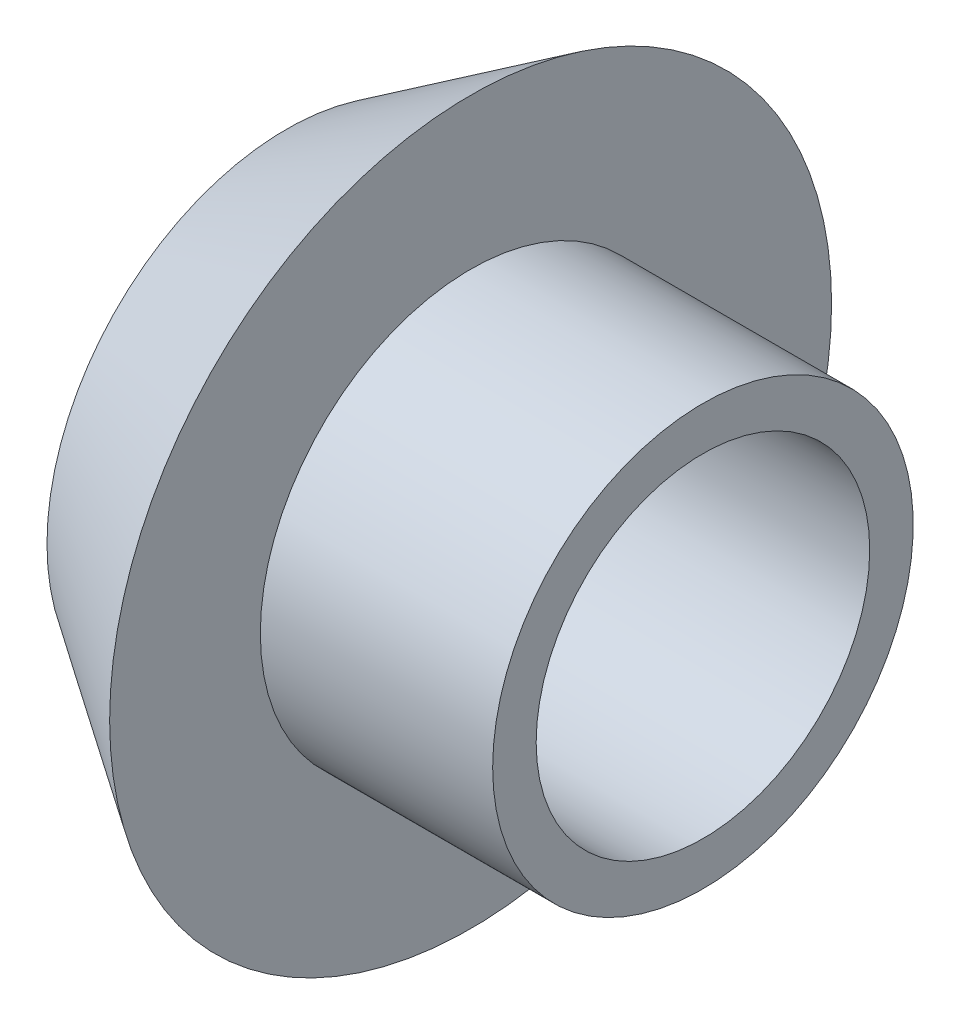
ISO-10303-21;
HEADER;
FILE_DESCRIPTION(('STEP AP214'),'2;1');
FILE_NAME('part.step','',(''),(''),'','','');
FILE_SCHEMA(('AUTOMOTIVE_DESIGN { 1 0 10303 214 1 1 1 1 }'));
ENDSEC;
DATA;
#1=APPLICATION_CONTEXT('core data for automotive mechanical design processes');
#2=APPLICATION_PROTOCOL_DEFINITION('international standard','automotive_design',2000,#1);
#3=PRODUCT_CONTEXT('',#1,'mechanical');
#4=PRODUCT('Part','Part','',(#3));
#5=PRODUCT_RELATED_PRODUCT_CATEGORY('part','',(#4));
#6=PRODUCT_DEFINITION_FORMATION('','',#4);
#7=PRODUCT_DEFINITION_CONTEXT('part definition',#1,'design');
#8=PRODUCT_DEFINITION('design','',#6,#7);
#9=PRODUCT_DEFINITION_SHAPE('','',#8);
#10=(LENGTH_UNIT() NAMED_UNIT(*) SI_UNIT(.MILLI.,.METRE.));
#11=(NAMED_UNIT(*) PLANE_ANGLE_UNIT() SI_UNIT($,.RADIAN.));
#12=(NAMED_UNIT(*) SI_UNIT($,.STERADIAN.) SOLID_ANGLE_UNIT());
#13=UNCERTAINTY_MEASURE_WITH_UNIT(LENGTH_MEASURE(1.E-05),#10,'distance_accuracy_value','');
#14=(GEOMETRIC_REPRESENTATION_CONTEXT(3) GLOBAL_UNCERTAINTY_ASSIGNED_CONTEXT((#13)) GLOBAL_UNIT_ASSIGNED_CONTEXT((#10,
#11,#12)) REPRESENTATION_CONTEXT('',''));
#15=CARTESIAN_POINT('',(0.,0.,0.));
#16=DIRECTION('',(0.,0.,1.));
#17=DIRECTION('',(1.,0.,0.));
#18=AXIS2_PLACEMENT_3D('',#15,#16,#17);
#19=CARTESIAN_POINT('',(-14.36,11.5,0.));
#20=DIRECTION('',(1.,0.,0.));
#21=DIRECTION('',(0.,0.,-1.));
#22=AXIS2_PLACEMENT_3D('',#19,#20,#21);
#23=PLANE('',#22);
#24=CARTESIAN_POINT('',(-14.36,0.,0.));
#25=DIRECTION('',(-1.,0.,0.));
#26=DIRECTION('',(0.,0.,1.));
#27=AXIS2_PLACEMENT_3D('',#24,#25,#26);
#28=CIRCLE('',#27,11.5);
#29=CARTESIAN_POINT('',(-14.36,0.,11.5));
#30=VERTEX_POINT('',#29);
#31=EDGE_CURVE('E52',#30,#30,#28,.T.);
#32=ORIENTED_EDGE('',*,*,#31,.F.);
#33=EDGE_LOOP('',(#32));
#34=FACE_BOUND('',#33,.T.);
#35=CARTESIAN_POINT('',(-14.36,0.,0.));
#36=DIRECTION('',(-1.,0.,0.));
#37=DIRECTION('',(0.,0.,1.));
#38=AXIS2_PLACEMENT_3D('',#35,#36,#37);
#39=CIRCLE('',#38,16.51);
#40=CARTESIAN_POINT('',(-14.36,0.,16.51));
#41=VERTEX_POINT('',#40);
#42=EDGE_CURVE('E10',#41,#41,#39,.T.);
#43=ORIENTED_EDGE('',*,*,#42,.T.);
#44=EDGE_LOOP('',(#43));
#45=FACE_BOUND('',#44,.T.);
#46=ADVANCED_FACE('F30',(#34,#45),#23,.F.);
#47=CARTESIAN_POINT('',(-1.66,0.,0.));
#48=DIRECTION('',(1.,0.,0.));
#49=DIRECTION('',(0.,0.,-1.));
#50=AXIS2_PLACEMENT_3D('',#47,#48,#49);
#51=CONICAL_SURFACE('',#50,24.89,0.583263302538101);
#52=ORIENTED_EDGE('',*,*,#42,.F.);
#53=EDGE_LOOP('',(#52));
#54=FACE_BOUND('',#53,.T.);
#55=CARTESIAN_POINT('',(-1.66,0.,0.));
#56=DIRECTION('',(-1.,0.,0.));
#57=DIRECTION('',(0.,0.,1.));
#58=AXIS2_PLACEMENT_3D('',#55,#56,#57);
#59=CIRCLE('',#58,24.89);
#60=CARTESIAN_POINT('',(-1.66,0.,24.89));
#61=VERTEX_POINT('',#60);
#62=EDGE_CURVE('E36',#61,#61,#59,.T.);
#63=ORIENTED_EDGE('',*,*,#62,.T.);
#64=EDGE_LOOP('',(#63));
#65=FACE_BOUND('',#64,.T.);
#66=ADVANCED_FACE('F59',(#54,#65),#51,.T.);
#67=CARTESIAN_POINT('',(-1.66,24.89,0.));
#68=DIRECTION('',(-1.,0.,0.));
#69=DIRECTION('',(0.,0.,1.));
#70=AXIS2_PLACEMENT_3D('',#67,#68,#69);
#71=PLANE('',#70);
#72=ORIENTED_EDGE('',*,*,#62,.F.);
#73=EDGE_LOOP('',(#72));
#74=FACE_BOUND('',#73,.T.);
#75=CARTESIAN_POINT('',(-1.66,0.,0.));
#76=DIRECTION('',(-1.,0.,0.));
#77=DIRECTION('',(0.,0.,1.));
#78=AXIS2_PLACEMENT_3D('',#75,#76,#77);
#79=CIRCLE('',#78,14.5);
#80=CARTESIAN_POINT('',(-1.66,0.,14.5));
#81=VERTEX_POINT('',#80);
#82=EDGE_CURVE('E40',#81,#81,#79,.T.);
#83=ORIENTED_EDGE('',*,*,#82,.T.);
#84=EDGE_LOOP('',(#83));
#85=FACE_BOUND('',#84,.T.);
#86=ADVANCED_FACE('F63',(#74,#85),#71,.F.);
#87=CARTESIAN_POINT('',(-14.36,0.,0.));
#88=DIRECTION('',(-1.,0.,0.));
#89=DIRECTION('',(0.,0.,1.));
#90=AXIS2_PLACEMENT_3D('',#87,#88,#89);
#91=CYLINDRICAL_SURFACE('',#90,14.5);
#92=ORIENTED_EDGE('',*,*,#82,.F.);
#93=EDGE_LOOP('',(#92));
#94=FACE_BOUND('',#93,.T.);
#95=CARTESIAN_POINT('',(14.36,0.,0.));
#96=DIRECTION('',(-1.,0.,0.));
#97=DIRECTION('',(0.,0.,1.));
#98=AXIS2_PLACEMENT_3D('',#95,#96,#97);
#99=CIRCLE('',#98,14.5);
#100=CARTESIAN_POINT('',(14.36,0.,14.5));
#101=VERTEX_POINT('',#100);
#102=EDGE_CURVE('E44',#101,#101,#99,.T.);
#103=ORIENTED_EDGE('',*,*,#102,.T.);
#104=EDGE_LOOP('',(#103));
#105=FACE_BOUND('',#104,.T.);
#106=ADVANCED_FACE('F68',(#94,#105),#91,.T.);
#107=CARTESIAN_POINT('',(14.36,14.5,0.));
#108=DIRECTION('',(-1.,0.,0.));
#109=DIRECTION('',(0.,0.,1.));
#110=AXIS2_PLACEMENT_3D('',#107,#108,#109);
#111=PLANE('',#110);
#112=ORIENTED_EDGE('',*,*,#102,.F.);
#113=EDGE_LOOP('',(#112));
#114=FACE_BOUND('',#113,.T.);
#115=CARTESIAN_POINT('',(14.36,0.,0.));
#116=DIRECTION('',(-1.,0.,0.));
#117=DIRECTION('',(0.,0.,1.));
#118=AXIS2_PLACEMENT_3D('',#115,#116,#117);
#119=CIRCLE('',#118,11.5);
#120=CARTESIAN_POINT('',(14.36,0.,11.5));
#121=VERTEX_POINT('',#120);
#122=EDGE_CURVE('E49',#121,#121,#119,.T.);
#123=ORIENTED_EDGE('',*,*,#122,.T.);
#124=EDGE_LOOP('',(#123));
#125=FACE_BOUND('',#124,.T.);
#126=ADVANCED_FACE('F74',(#114,#125),#111,.F.);
#127=CARTESIAN_POINT('',(-14.36,0.,0.));
#128=DIRECTION('',(-1.,0.,0.));
#129=DIRECTION('',(0.,0.,1.));
#130=AXIS2_PLACEMENT_3D('',#127,#128,#129);
#131=CYLINDRICAL_SURFACE('',#130,11.5);
#132=ORIENTED_EDGE('',*,*,#122,.F.);
#133=EDGE_LOOP('',(#132));
#134=FACE_BOUND('',#133,.T.);
#135=ORIENTED_EDGE('',*,*,#31,.T.);
#136=EDGE_LOOP('',(#135));
#137=FACE_BOUND('',#136,.T.);
#138=ADVANCED_FACE('F56',(#134,#137),#131,.F.);
#139=CLOSED_SHELL('',(#46,#66,#86,#106,#126,#138));
#140=MANIFOLD_SOLID_BREP('B2',#139);
#141=ADVANCED_BREP_SHAPE_REPRESENTATION('',(#18,#140),#14);
#142=SHAPE_DEFINITION_REPRESENTATION(#9,#141);
ENDSEC;
END-ISO-10303-21;
